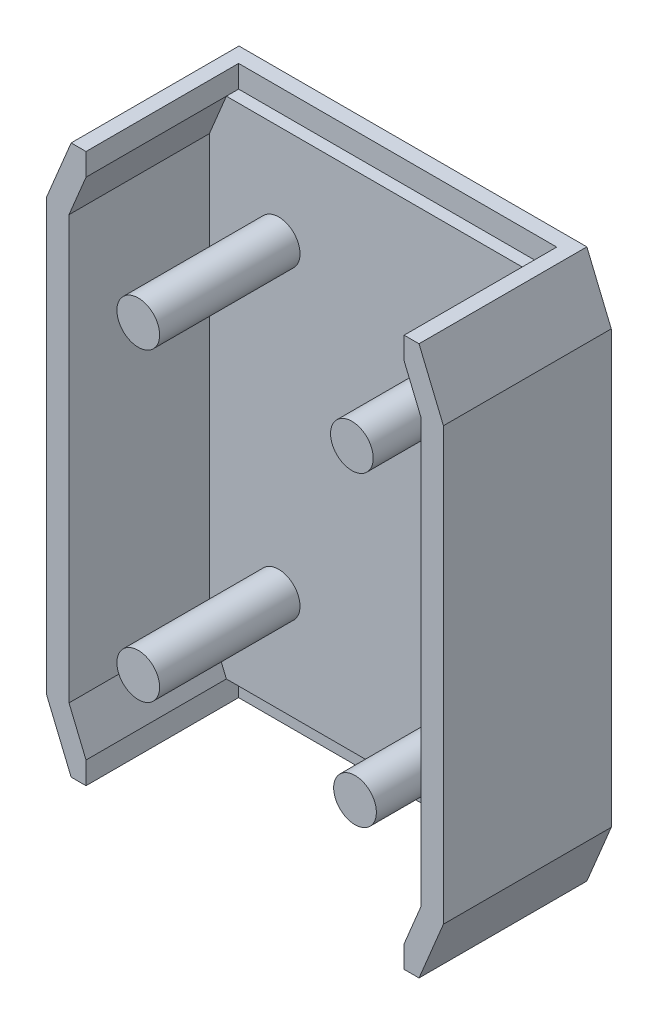
ISO-10303-21;
HEADER;
FILE_DESCRIPTION(('STEP AP214'),'2;1');
FILE_NAME('part.step','',(''),(''),'','','');
FILE_SCHEMA(('AUTOMOTIVE_DESIGN { 1 0 10303 214 1 1 1 1 }'));
ENDSEC;
DATA;
#1=APPLICATION_CONTEXT('core data for automotive mechanical design processes');
#2=APPLICATION_PROTOCOL_DEFINITION('international standard','automotive_design',2000,#1);
#3=PRODUCT_CONTEXT('',#1,'mechanical');
#4=PRODUCT('Part','Part','',(#3));
#5=PRODUCT_RELATED_PRODUCT_CATEGORY('part','',(#4));
#6=PRODUCT_DEFINITION_FORMATION('','',#4);
#7=PRODUCT_DEFINITION_CONTEXT('part definition',#1,'design');
#8=PRODUCT_DEFINITION('design','',#6,#7);
#9=PRODUCT_DEFINITION_SHAPE('','',#8);
#10=(LENGTH_UNIT() NAMED_UNIT(*) SI_UNIT(.MILLI.,.METRE.));
#11=(NAMED_UNIT(*) PLANE_ANGLE_UNIT() SI_UNIT($,.RADIAN.));
#12=(NAMED_UNIT(*) SI_UNIT($,.STERADIAN.) SOLID_ANGLE_UNIT());
#13=UNCERTAINTY_MEASURE_WITH_UNIT(LENGTH_MEASURE(1.E-05),#10,'distance_accuracy_value','');
#14=(GEOMETRIC_REPRESENTATION_CONTEXT(3) GLOBAL_UNCERTAINTY_ASSIGNED_CONTEXT((#13)) GLOBAL_UNIT_ASSIGNED_CONTEXT((#10,
#11,#12)) REPRESENTATION_CONTEXT('',''));
#15=CARTESIAN_POINT('',(0.,0.,0.));
#16=DIRECTION('',(0.,0.,1.));
#17=DIRECTION('',(1.,0.,0.));
#18=AXIS2_PLACEMENT_3D('',#15,#16,#17);
#19=CARTESIAN_POINT('',(0.,-57.15,5.715));
#20=DIRECTION('',(0.,1.,0.));
#21=DIRECTION('',(0.,0.,1.));
#22=AXIS2_PLACEMENT_3D('',#19,#20,#21);
#23=PLANE('',#22);
#24=DIRECTION('',(0.,0.,1.));
#25=VECTOR('',#24,1.);
#26=CARTESIAN_POINT('',(-33.1004294659972,-57.15,3.175));
#27=LINE('',#26,#25);
#28=CARTESIAN_POINT('',(-33.1004294659972,-57.15,3.175));
#29=VERTEX_POINT('',#28);
#30=CARTESIAN_POINT('',(-33.1004294659972,-57.15,34.925));
#31=VERTEX_POINT('',#30);
#32=EDGE_CURVE('E186',#29,#31,#27,.T.);
#33=ORIENTED_EDGE('',*,*,#32,.T.);
#34=DIRECTION('',(1.,0.,0.));
#35=VECTOR('',#34,1.);
#36=CARTESIAN_POINT('',(0.,-57.15,34.925));
#37=LINE('',#36,#35);
#38=CARTESIAN_POINT('',(-36.195,-57.15,34.925));
#39=VERTEX_POINT('',#38);
#40=EDGE_CURVE('E277',#39,#31,#37,.T.);
#41=ORIENTED_EDGE('',*,*,#40,.F.);
#42=DIRECTION('',(0.,0.,-1.));
#43=VECTOR('',#42,1.);
#44=CARTESIAN_POINT('',(-36.195,-57.15,5.715));
#45=LINE('',#44,#43);
#46=CARTESIAN_POINT('',(-36.195,-57.15,0.));
#47=VERTEX_POINT('',#46);
#48=EDGE_CURVE('E11',#39,#47,#45,.T.);
#49=ORIENTED_EDGE('',*,*,#48,.T.);
#50=DIRECTION('',(1.,0.,0.));
#51=VECTOR('',#50,1.);
#52=CARTESIAN_POINT('',(0.,-57.15,0.));
#53=LINE('',#52,#51);
#54=CARTESIAN_POINT('',(36.195,-57.15,0.));
#55=VERTEX_POINT('',#54);
#56=EDGE_CURVE('E336',#47,#55,#53,.T.);
#57=ORIENTED_EDGE('',*,*,#56,.T.);
#58=DIRECTION('',(0.,0.,-1.));
#59=VECTOR('',#58,1.);
#60=CARTESIAN_POINT('',(36.195,-57.15,5.715));
#61=LINE('',#60,#59);
#62=CARTESIAN_POINT('',(36.195,-57.1499999999999,34.925));
#63=VERTEX_POINT('',#62);
#64=EDGE_CURVE('E45',#63,#55,#61,.T.);
#65=ORIENTED_EDGE('',*,*,#64,.F.);
#66=CARTESIAN_POINT('',(33.1004294659972,-57.15,34.925));
#67=VERTEX_POINT('',#66);
#68=EDGE_CURVE('E276',#67,#63,#37,.T.);
#69=ORIENTED_EDGE('',*,*,#68,.F.);
#70=DIRECTION('',(0.,0.,1.));
#71=VECTOR('',#70,1.);
#72=CARTESIAN_POINT('',(33.1004294659972,-57.15,3.175));
#73=LINE('',#72,#71);
#74=CARTESIAN_POINT('',(33.1004294659972,-57.15,3.175));
#75=VERTEX_POINT('',#74);
#76=EDGE_CURVE('E198',#75,#67,#73,.T.);
#77=ORIENTED_EDGE('',*,*,#76,.F.);
#78=DIRECTION('',(-1.,0.,0.));
#79=VECTOR('',#78,1.);
#80=CARTESIAN_POINT('',(-33.1004294659972,-57.15,3.175));
#81=LINE('',#80,#79);
#82=EDGE_CURVE('E205',#75,#29,#81,.T.);
#83=ORIENTED_EDGE('',*,*,#82,.T.);
#84=EDGE_LOOP('',(#33,#41,#49,#57,#65,#69,#77,#83));
#85=FACE_BOUND('',#84,.T.);
#86=ADVANCED_FACE('F37',(#85),#23,.F.);
#87=CARTESIAN_POINT('',(0.,0.,34.925));
#88=DIRECTION('',(0.,0.,1.));
#89=DIRECTION('',(1.,0.,0.));
#90=AXIS2_PLACEMENT_3D('',#87,#88,#89);
#91=PLANE('',#90);
#92=ORIENTED_EDGE('',*,*,#40,.T.);
#93=DIRECTION('',(0.,1.,0.));
#94=VECTOR('',#93,1.);
#95=CARTESIAN_POINT('',(-33.1004294659972,-52.5145,34.925));
#96=LINE('',#95,#94);
#97=CARTESIAN_POINT('',(-33.1004294659972,-52.5145,34.925));
#98=VERTEX_POINT('',#97);
#99=EDGE_CURVE('E193',#31,#98,#96,.T.);
#100=ORIENTED_EDGE('',*,*,#99,.T.);
#101=DIRECTION('',(0.383447283100766,-0.923562765101886,0.));
#102=VECTOR('',#101,1.);
#103=CARTESIAN_POINT('',(-46.830973845541,-19.4434101986071,34.925));
#104=LINE('',#103,#102);
#105=CARTESIAN_POINT('',(-36.6395,-43.9903718803719,34.925));
#106=VERTEX_POINT('',#105);
#107=EDGE_CURVE('E264',#106,#98,#104,.T.);
#108=ORIENTED_EDGE('',*,*,#107,.F.);
#109=DIRECTION('',(0.,-1.,0.));
#110=VECTOR('',#109,1.);
#111=CARTESIAN_POINT('',(-36.6395,0.,34.925));
#112=LINE('',#111,#110);
#113=CARTESIAN_POINT('',(-36.6395,43.9903718803719,34.925));
#114=VERTEX_POINT('',#113);
#115=EDGE_CURVE('E267',#114,#106,#112,.T.);
#116=ORIENTED_EDGE('',*,*,#115,.F.);
#117=DIRECTION('',(-0.383447283100766,-0.923562765101886,0.));
#118=VECTOR('',#117,1.);
#119=CARTESIAN_POINT('',(-46.830973845541,19.443410198607,34.925));
#120=LINE('',#119,#118);
#121=CARTESIAN_POINT('',(-33.1004294659972,52.5145,34.925));
#122=VERTEX_POINT('',#121);
#123=EDGE_CURVE('E251',#122,#114,#120,.T.);
#124=ORIENTED_EDGE('',*,*,#123,.F.);
#125=DIRECTION('',(0.,-1.,0.));
#126=VECTOR('',#125,1.);
#127=CARTESIAN_POINT('',(-33.1004294659972,52.5145,34.925));
#128=LINE('',#127,#126);
#129=CARTESIAN_POINT('',(-33.1004294659972,57.15,34.925));
#130=VERTEX_POINT('',#129);
#131=EDGE_CURVE('E222',#130,#122,#128,.T.);
#132=ORIENTED_EDGE('',*,*,#131,.F.);
#133=DIRECTION('',(-1.,0.,0.));
#134=VECTOR('',#133,1.);
#135=CARTESIAN_POINT('',(0.,57.15,34.925));
#136=LINE('',#135,#134);
#137=CARTESIAN_POINT('',(-36.195,57.15,34.925));
#138=VERTEX_POINT('',#137);
#139=EDGE_CURVE('E288',#130,#138,#136,.T.);
#140=ORIENTED_EDGE('',*,*,#139,.T.);
#141=DIRECTION('',(-0.383447283100767,-0.923562765101886,0.));
#142=VECTOR('',#141,1.);
#143=CARTESIAN_POINT('',(-51.1121490431708,21.2208800794207,34.925));
#144=LINE('',#143,#142);
#145=CARTESIAN_POINT('',(-41.275,44.9144227681626,34.925));
#146=VERTEX_POINT('',#145);
#147=EDGE_CURVE('E292',#138,#146,#144,.T.);
#148=ORIENTED_EDGE('',*,*,#147,.T.);
#149=DIRECTION('',(0.,-1.,0.));
#150=VECTOR('',#149,1.);
#151=CARTESIAN_POINT('',(-41.275,0.,34.925));
#152=LINE('',#151,#150);
#153=CARTESIAN_POINT('',(-41.275,-44.9144227681627,34.925));
#154=VERTEX_POINT('',#153);
#155=EDGE_CURVE('E270',#146,#154,#152,.T.);
#156=ORIENTED_EDGE('',*,*,#155,.T.);
#157=DIRECTION('',(0.383447283100767,-0.923562765101886,0.));
#158=VECTOR('',#157,1.);
#159=CARTESIAN_POINT('',(-51.1121490431708,-21.2208800794207,34.925));
#160=LINE('',#159,#158);
#161=EDGE_CURVE('E273',#154,#39,#160,.T.);
#162=ORIENTED_EDGE('',*,*,#161,.T.);
#163=EDGE_LOOP('',(#92,#100,#108,#116,#124,#132,#140,#148,#156,#162));
#164=FACE_BOUND('',#163,.T.);
#165=ADVANCED_FACE('F401',(#164),#91,.T.);
#166=DIRECTION('',(0.383447283100766,0.923562765101886,0.));
#167=VECTOR('',#166,1.);
#168=CARTESIAN_POINT('',(46.830973845541,-19.443410198607,34.925));
#169=LINE('',#168,#167);
#170=CARTESIAN_POINT('',(33.1004294659972,-52.5145,34.925));
#171=VERTEX_POINT('',#170);
#172=CARTESIAN_POINT('',(36.6395,-43.9903718803721,34.925));
#173=VERTEX_POINT('',#172);
#174=EDGE_CURVE('E261',#171,#173,#169,.T.);
#175=ORIENTED_EDGE('',*,*,#174,.F.);
#176=DIRECTION('',(0.,-1.,0.));
#177=VECTOR('',#176,1.);
#178=CARTESIAN_POINT('',(33.1004294659972,-52.5145,34.925));
#179=LINE('',#178,#177);
#180=EDGE_CURVE('E207',#171,#67,#179,.T.);
#181=ORIENTED_EDGE('',*,*,#180,.T.);
#182=ORIENTED_EDGE('',*,*,#68,.T.);
#183=DIRECTION('',(0.383447283100766,0.923562765101886,0.));
#184=VECTOR('',#183,1.);
#185=CARTESIAN_POINT('',(51.1121490431708,-21.2208800794207,34.925));
#186=LINE('',#185,#184);
#187=CARTESIAN_POINT('',(41.275,-44.9144227681628,34.925));
#188=VERTEX_POINT('',#187);
#189=EDGE_CURVE('E279',#63,#188,#186,.T.);
#190=ORIENTED_EDGE('',*,*,#189,.T.);
#191=DIRECTION('',(0.,1.,0.));
#192=VECTOR('',#191,1.);
#193=CARTESIAN_POINT('',(41.275,0.,34.925));
#194=LINE('',#193,#192);
#195=CARTESIAN_POINT('',(41.275,44.9144227681628,34.925));
#196=VERTEX_POINT('',#195);
#197=EDGE_CURVE('E282',#188,#196,#194,.T.);
#198=ORIENTED_EDGE('',*,*,#197,.T.);
#199=DIRECTION('',(-0.383447283100766,0.923562765101886,0.));
#200=VECTOR('',#199,1.);
#201=CARTESIAN_POINT('',(51.1121490431708,21.2208800794207,34.925));
#202=LINE('',#201,#200);
#203=CARTESIAN_POINT('',(36.195,57.15,34.925));
#204=VERTEX_POINT('',#203);
#205=EDGE_CURVE('E285',#196,#204,#202,.T.);
#206=ORIENTED_EDGE('',*,*,#205,.T.);
#207=CARTESIAN_POINT('',(33.1004294659972,57.15,34.925));
#208=VERTEX_POINT('',#207);
#209=EDGE_CURVE('E289',#204,#208,#136,.T.);
#210=ORIENTED_EDGE('',*,*,#209,.T.);
#211=DIRECTION('',(0.,1.,0.));
#212=VECTOR('',#211,1.);
#213=CARTESIAN_POINT('',(33.1004294659972,52.5145,34.925));
#214=LINE('',#213,#212);
#215=CARTESIAN_POINT('',(33.1004294659972,52.5145,34.925));
#216=VERTEX_POINT('',#215);
#217=EDGE_CURVE('E230',#216,#208,#214,.T.);
#218=ORIENTED_EDGE('',*,*,#217,.F.);
#219=DIRECTION('',(-0.383447283100766,0.923562765101886,0.));
#220=VECTOR('',#219,1.);
#221=CARTESIAN_POINT('',(46.830973845541,19.443410198607,34.925));
#222=LINE('',#221,#220);
#223=CARTESIAN_POINT('',(36.6394999999999,43.9903718803721,34.925));
#224=VERTEX_POINT('',#223);
#225=EDGE_CURVE('E254',#224,#216,#222,.T.);
#226=ORIENTED_EDGE('',*,*,#225,.F.);
#227=DIRECTION('',(0.,1.,0.));
#228=VECTOR('',#227,1.);
#229=CARTESIAN_POINT('',(36.6395,0.,34.925));
#230=LINE('',#229,#228);
#231=EDGE_CURVE('E258',#173,#224,#230,.T.);
#232=ORIENTED_EDGE('',*,*,#231,.F.);
#233=EDGE_LOOP('',(#175,#181,#182,#190,#198,#206,#210,#218,#226,#232));
#234=FACE_BOUND('',#233,.T.);
#235=ADVANCED_FACE('F384',(#234),#91,.T.);
#236=CARTESIAN_POINT('',(-51.1121490431708,-21.2208800794207,5.715));
#237=DIRECTION('',(-0.923562765101886,-0.383447283100766,0.));
#238=DIRECTION('',(0.383447283100767,-0.923562765101886,0.));
#239=AXIS2_PLACEMENT_3D('',#236,#237,#238);
#240=PLANE('',#239);
#241=DIRECTION('',(-0.383447283100767,0.923562765101886,0.));
#242=VECTOR('',#241,1.);
#243=CARTESIAN_POINT('',(-51.1121490431708,-21.2208800794207,0.));
#244=LINE('',#243,#242);
#245=CARTESIAN_POINT('',(-41.275,-44.9144227681627,0.));
#246=VERTEX_POINT('',#245);
#247=EDGE_CURVE('E333',#47,#246,#244,.T.);
#248=ORIENTED_EDGE('',*,*,#247,.F.);
#249=ORIENTED_EDGE('',*,*,#48,.F.);
#250=ORIENTED_EDGE('',*,*,#161,.F.);
#251=DIRECTION('',(0.,0.,-1.));
#252=VECTOR('',#251,1.);
#253=CARTESIAN_POINT('',(-41.275,-44.9144227681627,5.715));
#254=LINE('',#253,#252);
#255=EDGE_CURVE('E355',#154,#246,#254,.T.);
#256=ORIENTED_EDGE('',*,*,#255,.T.);
#257=EDGE_LOOP('',(#248,#249,#250,#256));
#258=FACE_BOUND('',#257,.T.);
#259=ADVANCED_FACE('F39',(#258),#240,.T.);
#260=CARTESIAN_POINT('',(51.1121490431708,-21.2208800794207,5.715));
#261=DIRECTION('',(-0.923562765101886,0.383447283100766,0.));
#262=DIRECTION('',(-0.383447283100766,-0.923562765101886,0.));
#263=AXIS2_PLACEMENT_3D('',#260,#261,#262);
#264=PLANE('',#263);
#265=DIRECTION('',(0.383447283100766,0.923562765101886,0.));
#266=VECTOR('',#265,1.);
#267=CARTESIAN_POINT('',(51.1121490431708,-21.2208800794207,0.));
#268=LINE('',#267,#266);
#269=CARTESIAN_POINT('',(41.275,-44.9144227681628,0.));
#270=VERTEX_POINT('',#269);
#271=EDGE_CURVE('E338',#55,#270,#268,.T.);
#272=ORIENTED_EDGE('',*,*,#271,.T.);
#273=DIRECTION('',(0.,0.,-1.));
#274=VECTOR('',#273,1.);
#275=CARTESIAN_POINT('',(41.275,-44.9144227681628,5.715));
#276=LINE('',#275,#274);
#277=EDGE_CURVE('E366',#188,#270,#276,.T.);
#278=ORIENTED_EDGE('',*,*,#277,.F.);
#279=ORIENTED_EDGE('',*,*,#189,.F.);
#280=ORIENTED_EDGE('',*,*,#64,.T.);
#281=EDGE_LOOP('',(#272,#278,#279,#280));
#282=FACE_BOUND('',#281,.T.);
#283=ADVANCED_FACE('F372',(#282),#264,.F.);
#284=CARTESIAN_POINT('',(41.275,0.,5.715));
#285=DIRECTION('',(1.,0.,0.));
#286=DIRECTION('',(0.,1.,0.));
#287=AXIS2_PLACEMENT_3D('',#284,#285,#286);
#288=PLANE('',#287);
#289=DIRECTION('',(0.,-1.,0.));
#290=VECTOR('',#289,1.);
#291=CARTESIAN_POINT('',(41.275,0.,0.));
#292=LINE('',#291,#290);
#293=CARTESIAN_POINT('',(41.275,44.9144227681628,0.));
#294=VERTEX_POINT('',#293);
#295=EDGE_CURVE('E341',#294,#270,#292,.T.);
#296=ORIENTED_EDGE('',*,*,#295,.F.);
#297=DIRECTION('',(0.,0.,-1.));
#298=VECTOR('',#297,1.);
#299=CARTESIAN_POINT('',(41.275,44.9144227681628,5.715));
#300=LINE('',#299,#298);
#301=EDGE_CURVE('E364',#196,#294,#300,.T.);
#302=ORIENTED_EDGE('',*,*,#301,.F.);
#303=ORIENTED_EDGE('',*,*,#197,.F.);
#304=ORIENTED_EDGE('',*,*,#277,.T.);
#305=EDGE_LOOP('',(#296,#302,#303,#304));
#306=FACE_BOUND('',#305,.T.);
#307=ADVANCED_FACE('F380',(#306),#288,.T.);
#308=CARTESIAN_POINT('',(51.1121490431708,21.2208800794207,5.715));
#309=DIRECTION('',(0.923562765101886,0.383447283100766,0.));
#310=DIRECTION('',(-0.383447283100766,0.923562765101886,0.));
#311=AXIS2_PLACEMENT_3D('',#308,#309,#310);
#312=PLANE('',#311);
#313=DIRECTION('',(0.383447283100766,-0.923562765101886,0.));
#314=VECTOR('',#313,1.);
#315=CARTESIAN_POINT('',(51.1121490431708,21.2208800794207,0.));
#316=LINE('',#315,#314);
#317=CARTESIAN_POINT('',(36.195,57.15,0.));
#318=VERTEX_POINT('',#317);
#319=EDGE_CURVE('E344',#318,#294,#316,.T.);
#320=ORIENTED_EDGE('',*,*,#319,.F.);
#321=DIRECTION('',(0.,0.,-1.));
#322=VECTOR('',#321,1.);
#323=CARTESIAN_POINT('',(36.195,57.15,5.715));
#324=LINE('',#323,#322);
#325=EDGE_CURVE('E362',#204,#318,#324,.T.);
#326=ORIENTED_EDGE('',*,*,#325,.F.);
#327=ORIENTED_EDGE('',*,*,#205,.F.);
#328=ORIENTED_EDGE('',*,*,#301,.T.);
#329=EDGE_LOOP('',(#320,#326,#327,#328));
#330=FACE_BOUND('',#329,.T.);
#331=ADVANCED_FACE('F441',(#330),#312,.T.);
#332=CARTESIAN_POINT('',(0.,57.15,5.715));
#333=DIRECTION('',(0.,1.,0.));
#334=DIRECTION('',(0.,0.,1.));
#335=AXIS2_PLACEMENT_3D('',#332,#333,#334);
#336=PLANE('',#335);
#337=DIRECTION('',(0.,0.,1.));
#338=VECTOR('',#337,1.);
#339=CARTESIAN_POINT('',(-33.1004294659972,57.15,3.175));
#340=LINE('',#339,#338);
#341=CARTESIAN_POINT('',(-33.1004294659972,57.15,3.175));
#342=VERTEX_POINT('',#341);
#343=EDGE_CURVE('E241',#342,#130,#340,.T.);
#344=ORIENTED_EDGE('',*,*,#343,.F.);
#345=DIRECTION('',(-1.,0.,0.));
#346=VECTOR('',#345,1.);
#347=CARTESIAN_POINT('',(-33.1004294659972,57.15,3.175));
#348=LINE('',#347,#346);
#349=CARTESIAN_POINT('',(33.1004294659972,57.15,3.175));
#350=VERTEX_POINT('',#349);
#351=EDGE_CURVE('E236',#350,#342,#348,.T.);
#352=ORIENTED_EDGE('',*,*,#351,.F.);
#353=DIRECTION('',(0.,0.,1.));
#354=VECTOR('',#353,1.);
#355=CARTESIAN_POINT('',(33.1004294659972,57.15,3.175));
#356=LINE('',#355,#354);
#357=EDGE_CURVE('E244',#350,#208,#356,.T.);
#358=ORIENTED_EDGE('',*,*,#357,.T.);
#359=ORIENTED_EDGE('',*,*,#209,.F.);
#360=ORIENTED_EDGE('',*,*,#325,.T.);
#361=DIRECTION('',(1.,0.,0.));
#362=VECTOR('',#361,1.);
#363=CARTESIAN_POINT('',(0.,57.15,0.));
#364=LINE('',#363,#362);
#365=CARTESIAN_POINT('',(-36.195,57.15,0.));
#366=VERTEX_POINT('',#365);
#367=EDGE_CURVE('E347',#366,#318,#364,.T.);
#368=ORIENTED_EDGE('',*,*,#367,.F.);
#369=DIRECTION('',(0.,0.,-1.));
#370=VECTOR('',#369,1.);
#371=CARTESIAN_POINT('',(-36.195,57.15,5.715));
#372=LINE('',#371,#370);
#373=EDGE_CURVE('E360',#138,#366,#372,.T.);
#374=ORIENTED_EDGE('',*,*,#373,.F.);
#375=ORIENTED_EDGE('',*,*,#139,.F.);
#376=EDGE_LOOP('',(#344,#352,#358,#359,#360,#368,#374,#375));
#377=FACE_BOUND('',#376,.T.);
#378=ADVANCED_FACE('F427',(#377),#336,.T.);
#379=CARTESIAN_POINT('',(-51.1121490431708,21.2208800794207,5.715));
#380=DIRECTION('',(0.923562765101886,-0.383447283100766,0.));
#381=DIRECTION('',(0.383447283100767,0.923562765101886,0.));
#382=AXIS2_PLACEMENT_3D('',#379,#380,#381);
#383=PLANE('',#382);
#384=DIRECTION('',(-0.383447283100767,-0.923562765101886,0.));
#385=VECTOR('',#384,1.);
#386=CARTESIAN_POINT('',(-51.1121490431708,21.2208800794207,0.));
#387=LINE('',#386,#385);
#388=CARTESIAN_POINT('',(-41.275,44.9144227681626,0.));
#389=VERTEX_POINT('',#388);
#390=EDGE_CURVE('E350',#366,#389,#387,.T.);
#391=ORIENTED_EDGE('',*,*,#390,.T.);
#392=DIRECTION('',(0.,0.,-1.));
#393=VECTOR('',#392,1.);
#394=CARTESIAN_POINT('',(-41.275,44.9144227681626,5.715));
#395=LINE('',#394,#393);
#396=EDGE_CURVE('E357',#146,#389,#395,.T.);
#397=ORIENTED_EDGE('',*,*,#396,.F.);
#398=ORIENTED_EDGE('',*,*,#147,.F.);
#399=ORIENTED_EDGE('',*,*,#373,.T.);
#400=EDGE_LOOP('',(#391,#397,#398,#399));
#401=FACE_BOUND('',#400,.T.);
#402=ADVANCED_FACE('F469',(#401),#383,.F.);
#403=CARTESIAN_POINT('',(-41.275,0.,5.715));
#404=DIRECTION('',(1.,0.,0.));
#405=DIRECTION('',(0.,1.,0.));
#406=AXIS2_PLACEMENT_3D('',#403,#404,#405);
#407=PLANE('',#406);
#408=DIRECTION('',(0.,-1.,0.));
#409=VECTOR('',#408,1.);
#410=CARTESIAN_POINT('',(-41.275,0.,0.));
#411=LINE('',#410,#409);
#412=EDGE_CURVE('E352',#389,#246,#411,.T.);
#413=ORIENTED_EDGE('',*,*,#412,.T.);
#414=ORIENTED_EDGE('',*,*,#255,.F.);
#415=ORIENTED_EDGE('',*,*,#155,.F.);
#416=ORIENTED_EDGE('',*,*,#396,.T.);
#417=EDGE_LOOP('',(#413,#414,#415,#416));
#418=FACE_BOUND('',#417,.T.);
#419=ADVANCED_FACE('F434',(#418),#407,.F.);
#420=CARTESIAN_POINT('',(0.,0.,0.));
#421=DIRECTION('',(0.,0.,1.));
#422=DIRECTION('',(1.,0.,0.));
#423=AXIS2_PLACEMENT_3D('',#420,#421,#422);
#424=PLANE('',#423);
#425=ORIENTED_EDGE('',*,*,#247,.T.);
#426=ORIENTED_EDGE('',*,*,#412,.F.);
#427=ORIENTED_EDGE('',*,*,#390,.F.);
#428=ORIENTED_EDGE('',*,*,#367,.T.);
#429=ORIENTED_EDGE('',*,*,#319,.T.);
#430=ORIENTED_EDGE('',*,*,#295,.T.);
#431=ORIENTED_EDGE('',*,*,#271,.F.);
#432=ORIENTED_EDGE('',*,*,#56,.F.);
#433=EDGE_LOOP('',(#425,#426,#427,#428,#429,#430,#431,#432));
#434=FACE_BOUND('',#433,.T.);
#435=ADVANCED_FACE('F375',(#434),#424,.F.);
#436=CARTESIAN_POINT('',(-46.830973845541,19.443410198607,34.925));
#437=DIRECTION('',(0.923562765101886,-0.383447283100766,0.));
#438=DIRECTION('',(0.383447283100766,0.923562765101886,0.));
#439=AXIS2_PLACEMENT_3D('',#436,#437,#438);
#440=PLANE('',#439);
#441=DIRECTION('',(-0.383447283100766,-0.923562765101886,0.));
#442=VECTOR('',#441,1.);
#443=CARTESIAN_POINT('',(-46.830973845541,19.443410198607,5.715));
#444=LINE('',#443,#442);
#445=CARTESIAN_POINT('',(-33.1004294659972,52.5145,5.715));
#446=VERTEX_POINT('',#445);
#447=CARTESIAN_POINT('',(-36.6395,43.9903718803719,5.715));
#448=VERTEX_POINT('',#447);
#449=EDGE_CURVE('E243',#446,#448,#444,.T.);
#450=ORIENTED_EDGE('',*,*,#449,.F.);
#451=DIRECTION('',(0.,0.,-1.));
#452=VECTOR('',#451,1.);
#453=CARTESIAN_POINT('',(-33.1004294659972,52.5145,34.925));
#454=LINE('',#453,#452);
#455=EDGE_CURVE('E331',#122,#446,#454,.T.);
#456=ORIENTED_EDGE('',*,*,#455,.F.);
#457=ORIENTED_EDGE('',*,*,#123,.T.);
#458=DIRECTION('',(0.,0.,-1.));
#459=VECTOR('',#458,1.);
#460=CARTESIAN_POINT('',(-36.6395,43.9903718803719,34.925));
#461=LINE('',#460,#459);
#462=EDGE_CURVE('E295',#114,#448,#461,.T.);
#463=ORIENTED_EDGE('',*,*,#462,.T.);
#464=EDGE_LOOP('',(#450,#456,#457,#463));
#465=FACE_BOUND('',#464,.T.);
#466=ADVANCED_FACE('F413',(#465),#440,.T.);
#467=CARTESIAN_POINT('',(46.830973845541,19.443410198607,34.925));
#468=DIRECTION('',(-0.923562765101886,-0.383447283100766,0.));
#469=DIRECTION('',(0.383447283100766,-0.923562765101886,0.));
#470=AXIS2_PLACEMENT_3D('',#467,#468,#469);
#471=PLANE('',#470);
#472=DIRECTION('',(-0.383447283100766,0.923562765101886,0.));
#473=VECTOR('',#472,1.);
#474=CARTESIAN_POINT('',(46.830973845541,19.443410198607,5.715));
#475=LINE('',#474,#473);
#476=CARTESIAN_POINT('',(36.6395,43.9903718803721,5.715));
#477=VERTEX_POINT('',#476);
#478=CARTESIAN_POINT('',(33.1004294659972,52.5145,5.715));
#479=VERTEX_POINT('',#478);
#480=EDGE_CURVE('E300',#477,#479,#475,.T.);
#481=ORIENTED_EDGE('',*,*,#480,.F.);
#482=DIRECTION('',(0.,0.,-1.));
#483=VECTOR('',#482,1.);
#484=CARTESIAN_POINT('',(36.6394999999999,43.9903718803721,34.925));
#485=LINE('',#484,#483);
#486=EDGE_CURVE('E326',#224,#477,#485,.T.);
#487=ORIENTED_EDGE('',*,*,#486,.F.);
#488=ORIENTED_EDGE('',*,*,#225,.T.);
#489=DIRECTION('',(0.,0.,-1.));
#490=VECTOR('',#489,1.);
#491=CARTESIAN_POINT('',(33.1004294659972,52.5145,34.925));
#492=LINE('',#491,#490);
#493=EDGE_CURVE('E328',#216,#479,#492,.T.);
#494=ORIENTED_EDGE('',*,*,#493,.T.);
#495=EDGE_LOOP('',(#481,#487,#488,#494));
#496=FACE_BOUND('',#495,.T.);
#497=ADVANCED_FACE('F444',(#496),#471,.T.);
#498=CARTESIAN_POINT('',(36.6395,0.,34.925));
#499=DIRECTION('',(-1.,0.,0.));
#500=DIRECTION('',(0.,-1.,0.));
#501=AXIS2_PLACEMENT_3D('',#498,#499,#500);
#502=PLANE('',#501);
#503=DIRECTION('',(0.,1.,0.));
#504=VECTOR('',#503,1.);
#505=CARTESIAN_POINT('',(36.6395,0.,5.715));
#506=LINE('',#505,#504);
#507=CARTESIAN_POINT('',(36.6395,-43.9903718803721,5.715));
#508=VERTEX_POINT('',#507);
#509=EDGE_CURVE('E60',#508,#477,#506,.T.);
#510=ORIENTED_EDGE('',*,*,#509,.F.);
#511=DIRECTION('',(0.,0.,-1.));
#512=VECTOR('',#511,1.);
#513=CARTESIAN_POINT('',(36.6395,-43.9903718803721,34.925));
#514=LINE('',#513,#512);
#515=EDGE_CURVE('E323',#173,#508,#514,.T.);
#516=ORIENTED_EDGE('',*,*,#515,.F.);
#517=ORIENTED_EDGE('',*,*,#231,.T.);
#518=ORIENTED_EDGE('',*,*,#486,.T.);
#519=EDGE_LOOP('',(#510,#516,#517,#518));
#520=FACE_BOUND('',#519,.T.);
#521=ADVANCED_FACE('F446',(#520),#502,.T.);
#522=CARTESIAN_POINT('',(46.830973845541,-19.443410198607,34.925));
#523=DIRECTION('',(-0.923562765101886,0.383447283100766,0.));
#524=DIRECTION('',(-0.383447283100766,-0.923562765101886,0.));
#525=AXIS2_PLACEMENT_3D('',#522,#523,#524);
#526=PLANE('',#525);
#527=DIRECTION('',(0.383447283100766,0.923562765101886,0.));
#528=VECTOR('',#527,1.);
#529=CARTESIAN_POINT('',(46.830973845541,-19.443410198607,5.715));
#530=LINE('',#529,#528);
#531=CARTESIAN_POINT('',(33.1004294659972,-52.5145,5.715));
#532=VERTEX_POINT('',#531);
#533=EDGE_CURVE('E303',#532,#508,#530,.T.);
#534=ORIENTED_EDGE('',*,*,#533,.F.);
#535=DIRECTION('',(0.,0.,-1.));
#536=VECTOR('',#535,1.);
#537=CARTESIAN_POINT('',(33.1004294659972,-52.5145,34.925));
#538=LINE('',#537,#536);
#539=EDGE_CURVE('E320',#171,#532,#538,.T.);
#540=ORIENTED_EDGE('',*,*,#539,.F.);
#541=ORIENTED_EDGE('',*,*,#174,.T.);
#542=ORIENTED_EDGE('',*,*,#515,.T.);
#543=EDGE_LOOP('',(#534,#540,#541,#542));
#544=FACE_BOUND('',#543,.T.);
#545=ADVANCED_FACE('F393',(#544),#526,.T.);
#546=CARTESIAN_POINT('',(-46.830973845541,-19.4434101986071,34.925));
#547=DIRECTION('',(0.923562765101886,0.383447283100766,0.));
#548=DIRECTION('',(-0.383447283100766,0.923562765101886,0.));
#549=AXIS2_PLACEMENT_3D('',#546,#547,#548);
#550=PLANE('',#549);
#551=DIRECTION('',(0.383447283100766,-0.923562765101886,0.));
#552=VECTOR('',#551,1.);
#553=CARTESIAN_POINT('',(-46.830973845541,-19.4434101986071,5.715));
#554=LINE('',#553,#552);
#555=CARTESIAN_POINT('',(-36.6395,-43.9903718803719,5.715));
#556=VERTEX_POINT('',#555);
#557=CARTESIAN_POINT('',(-33.1004294659972,-52.5145,5.715));
#558=VERTEX_POINT('',#557);
#559=EDGE_CURVE('E308',#556,#558,#554,.T.);
#560=ORIENTED_EDGE('',*,*,#559,.F.);
#561=DIRECTION('',(0.,0.,-1.));
#562=VECTOR('',#561,1.);
#563=CARTESIAN_POINT('',(-36.6395,-43.9903718803719,34.925));
#564=LINE('',#563,#562);
#565=EDGE_CURVE('E314',#106,#556,#564,.T.);
#566=ORIENTED_EDGE('',*,*,#565,.F.);
#567=ORIENTED_EDGE('',*,*,#107,.T.);
#568=DIRECTION('',(0.,0.,-1.));
#569=VECTOR('',#568,1.);
#570=CARTESIAN_POINT('',(-33.1004294659972,-52.5145,34.925));
#571=LINE('',#570,#569);
#572=EDGE_CURVE('E317',#98,#558,#571,.T.);
#573=ORIENTED_EDGE('',*,*,#572,.T.);
#574=EDGE_LOOP('',(#560,#566,#567,#573));
#575=FACE_BOUND('',#574,.T.);
#576=ADVANCED_FACE('F403',(#575),#550,.T.);
#577=CARTESIAN_POINT('',(-36.6395,0.,34.925));
#578=DIRECTION('',(1.,0.,0.));
#579=DIRECTION('',(0.,1.,0.));
#580=AXIS2_PLACEMENT_3D('',#577,#578,#579);
#581=PLANE('',#580);
#582=DIRECTION('',(0.,-1.,0.));
#583=VECTOR('',#582,1.);
#584=CARTESIAN_POINT('',(-36.6395,0.,5.715));
#585=LINE('',#584,#583);
#586=EDGE_CURVE('E255',#448,#556,#585,.T.);
#587=ORIENTED_EDGE('',*,*,#586,.F.);
#588=ORIENTED_EDGE('',*,*,#462,.F.);
#589=ORIENTED_EDGE('',*,*,#115,.T.);
#590=ORIENTED_EDGE('',*,*,#565,.T.);
#591=EDGE_LOOP('',(#587,#588,#589,#590));
#592=FACE_BOUND('',#591,.T.);
#593=ADVANCED_FACE('F406',(#592),#581,.T.);
#594=CARTESIAN_POINT('',(0.,0.,5.715));
#595=DIRECTION('',(0.,0.,1.));
#596=DIRECTION('',(1.,0.,0.));
#597=AXIS2_PLACEMENT_3D('',#594,#595,#596);
#598=PLANE('',#597);
#599=CARTESIAN_POINT('',(-22.225,31.75,5.715));
#600=DIRECTION('',(0.,0.,1.));
#601=DIRECTION('',(1.,0.,0.));
#602=AXIS2_PLACEMENT_3D('',#599,#600,#601);
#603=CIRCLE('',#602,4.445);
#604=CARTESIAN_POINT('',(-17.78,31.75,5.715));
#605=VERTEX_POINT('',#604);
#606=EDGE_CURVE('E782',#605,#605,#603,.T.);
#607=ORIENTED_EDGE('',*,*,#606,.F.);
#608=EDGE_LOOP('',(#607));
#609=FACE_BOUND('',#608,.T.);
#610=CARTESIAN_POINT('',(22.225,31.75,5.715));
#611=DIRECTION('',(0.,0.,1.));
#612=DIRECTION('',(1.,0.,0.));
#613=AXIS2_PLACEMENT_3D('',#610,#611,#612);
#614=CIRCLE('',#613,4.445);
#615=CARTESIAN_POINT('',(26.67,31.75,5.715));
#616=VERTEX_POINT('',#615);
#617=EDGE_CURVE('E781',#616,#616,#614,.T.);
#618=ORIENTED_EDGE('',*,*,#617,.F.);
#619=EDGE_LOOP('',(#618));
#620=FACE_BOUND('',#619,.T.);
#621=CARTESIAN_POINT('',(-22.225,-31.75,5.715));
#622=DIRECTION('',(0.,0.,1.));
#623=DIRECTION('',(1.,0.,0.));
#624=AXIS2_PLACEMENT_3D('',#621,#622,#623);
#625=CIRCLE('',#624,4.445);
#626=CARTESIAN_POINT('',(-17.78,-31.75,5.715));
#627=VERTEX_POINT('',#626);
#628=EDGE_CURVE('E791',#627,#627,#625,.T.);
#629=ORIENTED_EDGE('',*,*,#628,.F.);
#630=EDGE_LOOP('',(#629));
#631=FACE_BOUND('',#630,.T.);
#632=CARTESIAN_POINT('',(22.874903426531,-31.75,5.715));
#633=DIRECTION('',(0.,0.,1.));
#634=DIRECTION('',(1.,0.,0.));
#635=AXIS2_PLACEMENT_3D('',#632,#633,#634);
#636=CIRCLE('',#635,4.44499999999999);
#637=CARTESIAN_POINT('',(27.3199034265309,-31.75,5.715));
#638=VERTEX_POINT('',#637);
#639=EDGE_CURVE('E796',#638,#638,#636,.T.);
#640=ORIENTED_EDGE('',*,*,#639,.F.);
#641=EDGE_LOOP('',(#640));
#642=FACE_BOUND('',#641,.T.);
#643=ORIENTED_EDGE('',*,*,#449,.T.);
#644=ORIENTED_EDGE('',*,*,#586,.T.);
#645=ORIENTED_EDGE('',*,*,#559,.T.);
#646=DIRECTION('',(1.,0.,0.));
#647=VECTOR('',#646,1.);
#648=CARTESIAN_POINT('',(0.,-52.5145,5.715));
#649=LINE('',#648,#647);
#650=EDGE_CURVE('E305',#558,#532,#649,.T.);
#651=ORIENTED_EDGE('',*,*,#650,.T.);
#652=ORIENTED_EDGE('',*,*,#533,.T.);
#653=ORIENTED_EDGE('',*,*,#509,.T.);
#654=ORIENTED_EDGE('',*,*,#480,.T.);
#655=DIRECTION('',(-1.,0.,0.));
#656=VECTOR('',#655,1.);
#657=CARTESIAN_POINT('',(0.,52.5145,5.715));
#658=LINE('',#657,#656);
#659=EDGE_CURVE('E297',#479,#446,#658,.T.);
#660=ORIENTED_EDGE('',*,*,#659,.T.);
#661=EDGE_LOOP('',(#643,#644,#645,#651,#652,#653,#654,#660));
#662=FACE_BOUND('',#661,.T.);
#663=ADVANCED_FACE('F394',(#609,#620,#631,#642,#662),#598,.T.);
#664=CARTESIAN_POINT('',(-33.1004294659972,52.5145,3.175));
#665=DIRECTION('',(-1.,0.,0.));
#666=DIRECTION('',(0.,0.,1.));
#667=AXIS2_PLACEMENT_3D('',#664,#665,#666);
#668=PLANE('',#667);
#669=ORIENTED_EDGE('',*,*,#131,.T.);
#670=ORIENTED_EDGE('',*,*,#455,.T.);
#671=DIRECTION('',(0.,0.,1.));
#672=VECTOR('',#671,1.);
#673=CARTESIAN_POINT('',(-33.1004294659972,52.5145,3.175));
#674=LINE('',#673,#672);
#675=CARTESIAN_POINT('',(-33.1004294659972,52.5145,3.175));
#676=VERTEX_POINT('',#675);
#677=EDGE_CURVE('E52',#676,#446,#674,.T.);
#678=ORIENTED_EDGE('',*,*,#677,.F.);
#679=DIRECTION('',(0.,-1.,0.));
#680=VECTOR('',#679,1.);
#681=CARTESIAN_POINT('',(-33.1004294659972,52.5145,3.175));
#682=LINE('',#681,#680);
#683=EDGE_CURVE('E226',#342,#676,#682,.T.);
#684=ORIENTED_EDGE('',*,*,#683,.F.);
#685=ORIENTED_EDGE('',*,*,#343,.T.);
#686=EDGE_LOOP('',(#669,#670,#678,#684,#685));
#687=FACE_BOUND('',#686,.T.);
#688=ADVANCED_FACE('F415',(#687),#668,.F.);
#689=CARTESIAN_POINT('',(33.1004294659972,52.5145,3.175));
#690=DIRECTION('',(1.,0.,0.));
#691=DIRECTION('',(0.,0.,-1.));
#692=AXIS2_PLACEMENT_3D('',#689,#690,#691);
#693=PLANE('',#692);
#694=ORIENTED_EDGE('',*,*,#217,.T.);
#695=ORIENTED_EDGE('',*,*,#357,.F.);
#696=DIRECTION('',(0.,1.,0.));
#697=VECTOR('',#696,1.);
#698=CARTESIAN_POINT('',(33.1004294659972,52.5145,3.175));
#699=LINE('',#698,#697);
#700=CARTESIAN_POINT('',(33.1004294659972,52.5145,3.175));
#701=VERTEX_POINT('',#700);
#702=EDGE_CURVE('E233',#701,#350,#699,.T.);
#703=ORIENTED_EDGE('',*,*,#702,.F.);
#704=DIRECTION('',(0.,0.,1.));
#705=VECTOR('',#704,1.);
#706=CARTESIAN_POINT('',(33.1004294659972,52.5145,3.175));
#707=LINE('',#706,#705);
#708=EDGE_CURVE('E247',#701,#479,#707,.T.);
#709=ORIENTED_EDGE('',*,*,#708,.T.);
#710=ORIENTED_EDGE('',*,*,#493,.F.);
#711=EDGE_LOOP('',(#694,#695,#703,#709,#710));
#712=FACE_BOUND('',#711,.T.);
#713=ADVANCED_FACE('F420',(#712),#693,.F.);
#714=CARTESIAN_POINT('',(-33.1004294659972,52.5145,3.175));
#715=DIRECTION('',(0.,-1.,0.));
#716=DIRECTION('',(0.,0.,-1.));
#717=AXIS2_PLACEMENT_3D('',#714,#715,#716);
#718=PLANE('',#717);
#719=ORIENTED_EDGE('',*,*,#659,.F.);
#720=ORIENTED_EDGE('',*,*,#708,.F.);
#721=DIRECTION('',(1.,0.,0.));
#722=VECTOR('',#721,1.);
#723=CARTESIAN_POINT('',(-33.1004294659972,52.5145,3.175));
#724=LINE('',#723,#722);
#725=EDGE_CURVE('E229',#676,#701,#724,.T.);
#726=ORIENTED_EDGE('',*,*,#725,.F.);
#727=ORIENTED_EDGE('',*,*,#677,.T.);
#728=EDGE_LOOP('',(#719,#720,#726,#727));
#729=FACE_BOUND('',#728,.T.);
#730=ADVANCED_FACE('F417',(#729),#718,.F.);
#731=CARTESIAN_POINT('',(0.,0.,3.175));
#732=DIRECTION('',(0.,0.,-1.));
#733=DIRECTION('',(-1.,0.,0.));
#734=AXIS2_PLACEMENT_3D('',#731,#732,#733);
#735=PLANE('',#734);
#736=ORIENTED_EDGE('',*,*,#683,.T.);
#737=ORIENTED_EDGE('',*,*,#725,.T.);
#738=ORIENTED_EDGE('',*,*,#702,.T.);
#739=ORIENTED_EDGE('',*,*,#351,.T.);
#740=EDGE_LOOP('',(#736,#737,#738,#739));
#741=FACE_BOUND('',#740,.T.);
#742=ADVANCED_FACE('F424',(#741),#735,.F.);
#743=CARTESIAN_POINT('',(-33.1004294659972,-52.5145,3.175));
#744=DIRECTION('',(1.,0.,0.));
#745=DIRECTION('',(0.,0.,-1.));
#746=AXIS2_PLACEMENT_3D('',#743,#744,#745);
#747=PLANE('',#746);
#748=ORIENTED_EDGE('',*,*,#99,.F.);
#749=ORIENTED_EDGE('',*,*,#32,.F.);
#750=DIRECTION('',(0.,1.,0.));
#751=VECTOR('',#750,1.);
#752=CARTESIAN_POINT('',(-33.1004294659972,-52.5145,3.175));
#753=LINE('',#752,#751);
#754=CARTESIAN_POINT('',(-33.1004294659972,-52.5145,3.175));
#755=VERTEX_POINT('',#754);
#756=EDGE_CURVE('E190',#29,#755,#753,.T.);
#757=ORIENTED_EDGE('',*,*,#756,.T.);
#758=DIRECTION('',(0.,0.,1.));
#759=VECTOR('',#758,1.);
#760=CARTESIAN_POINT('',(-33.1004294659972,-52.5145,3.175));
#761=LINE('',#760,#759);
#762=EDGE_CURVE('E220',#755,#558,#761,.T.);
#763=ORIENTED_EDGE('',*,*,#762,.T.);
#764=ORIENTED_EDGE('',*,*,#572,.F.);
#765=EDGE_LOOP('',(#748,#749,#757,#763,#764));
#766=FACE_BOUND('',#765,.T.);
#767=ADVANCED_FACE('F188',(#766),#747,.T.);
#768=CARTESIAN_POINT('',(-33.1004294659972,-52.5145,3.175));
#769=DIRECTION('',(0.,-1.,0.));
#770=DIRECTION('',(0.,0.,-1.));
#771=AXIS2_PLACEMENT_3D('',#768,#769,#770);
#772=PLANE('',#771);
#773=ORIENTED_EDGE('',*,*,#762,.F.);
#774=DIRECTION('',(1.,0.,0.));
#775=VECTOR('',#774,1.);
#776=CARTESIAN_POINT('',(-33.1004294659972,-52.5145,3.175));
#777=LINE('',#776,#775);
#778=CARTESIAN_POINT('',(33.1004294659972,-52.5145,3.175));
#779=VERTEX_POINT('',#778);
#780=EDGE_CURVE('E199',#755,#779,#777,.T.);
#781=ORIENTED_EDGE('',*,*,#780,.T.);
#782=DIRECTION('',(0.,0.,1.));
#783=VECTOR('',#782,1.);
#784=CARTESIAN_POINT('',(33.1004294659972,-52.5145,3.175));
#785=LINE('',#784,#783);
#786=EDGE_CURVE('E223',#779,#532,#785,.T.);
#787=ORIENTED_EDGE('',*,*,#786,.T.);
#788=ORIENTED_EDGE('',*,*,#650,.F.);
#789=EDGE_LOOP('',(#773,#781,#787,#788));
#790=FACE_BOUND('',#789,.T.);
#791=ADVANCED_FACE('F397',(#790),#772,.T.);
#792=CARTESIAN_POINT('',(33.1004294659972,-52.5145,3.175));
#793=DIRECTION('',(-1.,0.,0.));
#794=DIRECTION('',(0.,0.,1.));
#795=AXIS2_PLACEMENT_3D('',#792,#793,#794);
#796=PLANE('',#795);
#797=ORIENTED_EDGE('',*,*,#180,.F.);
#798=ORIENTED_EDGE('',*,*,#539,.T.);
#799=ORIENTED_EDGE('',*,*,#786,.F.);
#800=DIRECTION('',(0.,-1.,0.));
#801=VECTOR('',#800,1.);
#802=CARTESIAN_POINT('',(33.1004294659972,-52.5145,3.175));
#803=LINE('',#802,#801);
#804=EDGE_CURVE('E210',#779,#75,#803,.T.);
#805=ORIENTED_EDGE('',*,*,#804,.T.);
#806=ORIENTED_EDGE('',*,*,#76,.T.);
#807=EDGE_LOOP('',(#797,#798,#799,#805,#806));
#808=FACE_BOUND('',#807,.T.);
#809=ADVANCED_FACE('F389',(#808),#796,.T.);
#810=CARTESIAN_POINT('',(0.,0.,3.175));
#811=DIRECTION('',(0.,0.,-1.));
#812=DIRECTION('',(-1.,0.,0.));
#813=AXIS2_PLACEMENT_3D('',#810,#811,#812);
#814=PLANE('',#813);
#815=ORIENTED_EDGE('',*,*,#756,.F.);
#816=ORIENTED_EDGE('',*,*,#82,.F.);
#817=ORIENTED_EDGE('',*,*,#804,.F.);
#818=ORIENTED_EDGE('',*,*,#780,.F.);
#819=EDGE_LOOP('',(#815,#816,#817,#818));
#820=FACE_BOUND('',#819,.T.);
#821=ADVANCED_FACE('F203',(#820),#814,.F.);
#822=CARTESIAN_POINT('',(22.874903426531,-31.75,34.925));
#823=DIRECTION('',(0.,0.,-1.));
#824=DIRECTION('',(-1.,0.,0.));
#825=AXIS2_PLACEMENT_3D('',#822,#823,#824);
#826=CYLINDRICAL_SURFACE('',#825,4.44499999999999);
#827=CARTESIAN_POINT('',(22.874903426531,-31.75,34.925));
#828=DIRECTION('',(0.,0.,1.));
#829=DIRECTION('',(1.,0.,0.));
#830=AXIS2_PLACEMENT_3D('',#827,#828,#829);
#831=CIRCLE('',#830,4.44499999999999);
#832=CARTESIAN_POINT('',(27.3199034265309,-31.75,34.925));
#833=VERTEX_POINT('',#832);
#834=EDGE_CURVE('E217',#833,#833,#831,.T.);
#835=ORIENTED_EDGE('',*,*,#834,.F.);
#836=EDGE_LOOP('',(#835));
#837=FACE_BOUND('',#836,.T.);
#838=ORIENTED_EDGE('',*,*,#639,.T.);
#839=EDGE_LOOP('',(#838));
#840=FACE_BOUND('',#839,.T.);
#841=ADVANCED_FACE('F591',(#837,#840),#826,.T.);
#842=CARTESIAN_POINT('',(22.874903426531,-31.75,34.925));
#843=DIRECTION('',(0.,0.,1.));
#844=DIRECTION('',(1.,0.,0.));
#845=AXIS2_PLACEMENT_3D('',#842,#843,#844);
#846=PLANE('',#845);
#847=ORIENTED_EDGE('',*,*,#834,.T.);
#848=EDGE_LOOP('',(#847));
#849=FACE_BOUND('',#848,.T.);
#850=ADVANCED_FACE('F604',(#849),#846,.T.);
#851=CARTESIAN_POINT('',(-22.225,-31.75,34.925));
#852=DIRECTION('',(0.,0.,-1.));
#853=DIRECTION('',(-1.,0.,0.));
#854=AXIS2_PLACEMENT_3D('',#851,#852,#853);
#855=CYLINDRICAL_SURFACE('',#854,4.445);
#856=CARTESIAN_POINT('',(-22.225,-31.75,34.925));
#857=DIRECTION('',(0.,0.,1.));
#858=DIRECTION('',(1.,0.,0.));
#859=AXIS2_PLACEMENT_3D('',#856,#857,#858);
#860=CIRCLE('',#859,4.445);
#861=CARTESIAN_POINT('',(-17.78,-31.75,34.925));
#862=VERTEX_POINT('',#861);
#863=EDGE_CURVE('E793',#862,#862,#860,.T.);
#864=ORIENTED_EDGE('',*,*,#863,.F.);
#865=EDGE_LOOP('',(#864));
#866=FACE_BOUND('',#865,.T.);
#867=ORIENTED_EDGE('',*,*,#628,.T.);
#868=EDGE_LOOP('',(#867));
#869=FACE_BOUND('',#868,.T.);
#870=ADVANCED_FACE('F614',(#866,#869),#855,.T.);
#871=CARTESIAN_POINT('',(-22.225,-31.75,34.925));
#872=DIRECTION('',(0.,0.,1.));
#873=DIRECTION('',(1.,0.,0.));
#874=AXIS2_PLACEMENT_3D('',#871,#872,#873);
#875=PLANE('',#874);
#876=ORIENTED_EDGE('',*,*,#863,.T.);
#877=EDGE_LOOP('',(#876));
#878=FACE_BOUND('',#877,.T.);
#879=ADVANCED_FACE('F624',(#878),#875,.T.);
#880=CARTESIAN_POINT('',(22.225,31.75,34.925));
#881=DIRECTION('',(0.,0.,-1.));
#882=DIRECTION('',(-1.,0.,0.));
#883=AXIS2_PLACEMENT_3D('',#880,#881,#882);
#884=CYLINDRICAL_SURFACE('',#883,4.445);
#885=CARTESIAN_POINT('',(22.225,31.75,34.925));
#886=DIRECTION('',(0.,0.,1.));
#887=DIRECTION('',(1.,0.,0.));
#888=AXIS2_PLACEMENT_3D('',#885,#886,#887);
#889=CIRCLE('',#888,4.445);
#890=CARTESIAN_POINT('',(26.67,31.75,34.925));
#891=VERTEX_POINT('',#890);
#892=EDGE_CURVE('E785',#891,#891,#889,.T.);
#893=ORIENTED_EDGE('',*,*,#892,.F.);
#894=EDGE_LOOP('',(#893));
#895=FACE_BOUND('',#894,.T.);
#896=ORIENTED_EDGE('',*,*,#617,.T.);
#897=EDGE_LOOP('',(#896));
#898=FACE_BOUND('',#897,.T.);
#899=ADVANCED_FACE('F634',(#895,#898),#884,.T.);
#900=CARTESIAN_POINT('',(22.225,31.75,34.925));
#901=DIRECTION('',(0.,0.,1.));
#902=DIRECTION('',(1.,0.,0.));
#903=AXIS2_PLACEMENT_3D('',#900,#901,#902);
#904=PLANE('',#903);
#905=ORIENTED_EDGE('',*,*,#892,.T.);
#906=EDGE_LOOP('',(#905));
#907=FACE_BOUND('',#906,.T.);
#908=ADVANCED_FACE('F644',(#907),#904,.T.);
#909=CARTESIAN_POINT('',(-22.225,31.75,34.925));
#910=DIRECTION('',(0.,0.,-1.));
#911=DIRECTION('',(-1.,0.,0.));
#912=AXIS2_PLACEMENT_3D('',#909,#910,#911);
#913=CYLINDRICAL_SURFACE('',#912,4.445);
#914=CARTESIAN_POINT('',(-22.225,31.75,34.925));
#915=DIRECTION('',(0.,0.,1.));
#916=DIRECTION('',(1.,0.,0.));
#917=AXIS2_PLACEMENT_3D('',#914,#915,#916);
#918=CIRCLE('',#917,4.445);
#919=CARTESIAN_POINT('',(-17.78,31.75,34.925));
#920=VERTEX_POINT('',#919);
#921=EDGE_CURVE('E780',#920,#920,#918,.T.);
#922=ORIENTED_EDGE('',*,*,#921,.F.);
#923=EDGE_LOOP('',(#922));
#924=FACE_BOUND('',#923,.T.);
#925=ORIENTED_EDGE('',*,*,#606,.T.);
#926=EDGE_LOOP('',(#925));
#927=FACE_BOUND('',#926,.T.);
#928=ADVANCED_FACE('F654',(#924,#927),#913,.T.);
#929=CARTESIAN_POINT('',(-22.225,31.75,34.925));
#930=DIRECTION('',(0.,0.,1.));
#931=DIRECTION('',(1.,0.,0.));
#932=AXIS2_PLACEMENT_3D('',#929,#930,#931);
#933=PLANE('',#932);
#934=ORIENTED_EDGE('',*,*,#921,.T.);
#935=EDGE_LOOP('',(#934));
#936=FACE_BOUND('',#935,.T.);
#937=ADVANCED_FACE('F664',(#936),#933,.T.);
#938=CLOSED_SHELL('',(#86,#165,#235,#259,#283,#307,#331,#378,#402,#419,#435,#466,#497,#521,#545,
#576,#593,#663,#688,#713,#730,#742,#767,#791,#809,#821,#841,#850,#870,#879,#899,#908,#928,#937));
#939=MANIFOLD_SOLID_BREP('B2',#938);
#940=ADVANCED_BREP_SHAPE_REPRESENTATION('',(#18,#939),#14);
#941=SHAPE_DEFINITION_REPRESENTATION(#9,#940);
ENDSEC;
END-ISO-10303-21;
